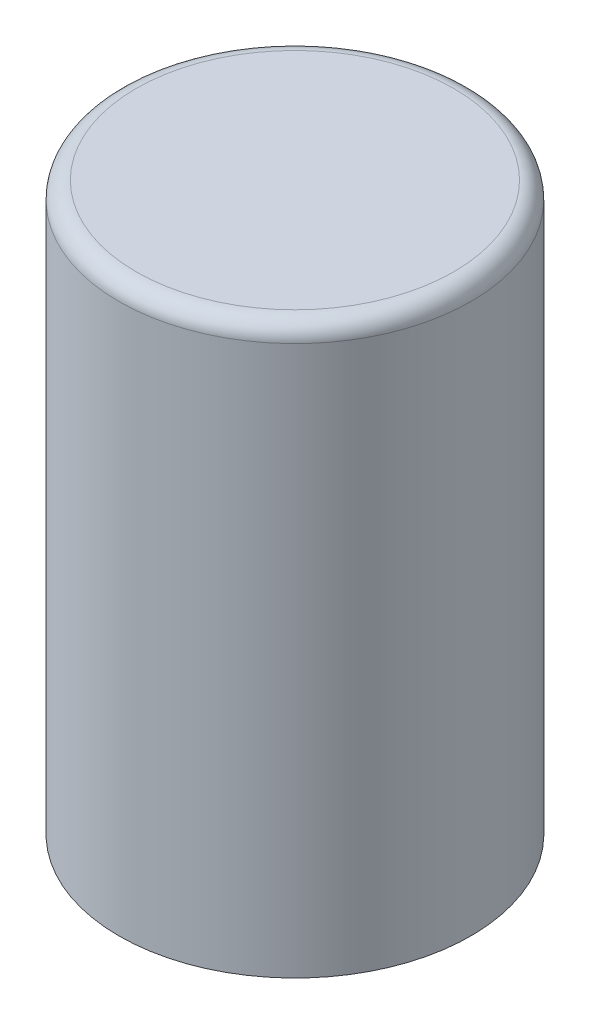
ISO-10303-21;
HEADER;
FILE_DESCRIPTION(('STEP AP214'),'2;1');
FILE_NAME('part.step','',(''),(''),'','','');
FILE_SCHEMA(('AUTOMOTIVE_DESIGN { 1 0 10303 214 1 1 1 1 }'));
ENDSEC;
DATA;
#1=APPLICATION_CONTEXT('core data for automotive mechanical design processes');
#2=APPLICATION_PROTOCOL_DEFINITION('international standard','automotive_design',2000,#1);
#3=PRODUCT_CONTEXT('',#1,'mechanical');
#4=PRODUCT('Part','Part','',(#3));
#5=PRODUCT_RELATED_PRODUCT_CATEGORY('part','',(#4));
#6=PRODUCT_DEFINITION_FORMATION('','',#4);
#7=PRODUCT_DEFINITION_CONTEXT('part definition',#1,'design');
#8=PRODUCT_DEFINITION('design','',#6,#7);
#9=PRODUCT_DEFINITION_SHAPE('','',#8);
#10=(LENGTH_UNIT() NAMED_UNIT(*) SI_UNIT(.MILLI.,.METRE.));
#11=(NAMED_UNIT(*) PLANE_ANGLE_UNIT() SI_UNIT($,.RADIAN.));
#12=(NAMED_UNIT(*) SI_UNIT($,.STERADIAN.) SOLID_ANGLE_UNIT());
#13=UNCERTAINTY_MEASURE_WITH_UNIT(LENGTH_MEASURE(1.E-05),#10,'distance_accuracy_value','');
#14=(GEOMETRIC_REPRESENTATION_CONTEXT(3) GLOBAL_UNCERTAINTY_ASSIGNED_CONTEXT((#13)) GLOBAL_UNIT_ASSIGNED_CONTEXT((#10,
#11,#12)) REPRESENTATION_CONTEXT('',''));
#15=CARTESIAN_POINT('',(0.,0.,0.));
#16=DIRECTION('',(0.,0.,1.));
#17=DIRECTION('',(1.,0.,0.));
#18=AXIS2_PLACEMENT_3D('',#15,#16,#17);
#19=CARTESIAN_POINT('',(26.069305705841,20.447980609798,0.182702431144));
#20=DIRECTION('',(0.,1.,0.));
#21=DIRECTION('',(0.,0.,1.));
#22=AXIS2_PLACEMENT_3D('',#19,#20,#21);
#23=PLANE('',#22);
#24=CARTESIAN_POINT('',(26.069305705841,20.447980609798,0.182702431144));
#25=DIRECTION('',(0.,-1.,0.));
#26=DIRECTION('',(0.,0.,-1.));
#27=AXIS2_PLACEMENT_3D('',#24,#25,#26);
#28=CIRCLE('',#27,4.625);
#29=CARTESIAN_POINT('',(26.069305705841,20.447980609798,-4.442297568856));
#30=VERTEX_POINT('',#29);
#31=CARTESIAN_POINT('',(26.069305705841,20.447980609798,4.807702431144));
#32=VERTEX_POINT('',#31);
#33=EDGE_CURVE('E40',#30,#32,#28,.T.);
#34=ORIENTED_EDGE('',*,*,#33,.F.);
#35=CARTESIAN_POINT('',(26.069305705841,20.447980609798,0.182702431144));
#36=DIRECTION('',(0.,-1.,0.));
#37=DIRECTION('',(0.,0.,1.));
#38=AXIS2_PLACEMENT_3D('',#35,#36,#37);
#39=CIRCLE('',#38,4.625);
#40=EDGE_CURVE('E34',#32,#30,#39,.T.);
#41=ORIENTED_EDGE('',*,*,#40,.F.);
#42=EDGE_LOOP('',(#34,#41));
#43=FACE_BOUND('',#42,.T.);
#44=ADVANCED_FACE('F17',(#43),#23,.T.);
#45=CARTESIAN_POINT('',(26.069305705841,19.947980609798,0.182702431144));
#46=DIRECTION('',(0.,1.,0.));
#47=DIRECTION('',(0.,0.,1.));
#48=AXIS2_PLACEMENT_3D('',#45,#46,#47);
#49=TOROIDAL_SURFACE('',#48,4.625,0.5);
#50=ORIENTED_EDGE('',*,*,#40,.T.);
#51=ORIENTED_EDGE('',*,*,#33,.T.);
#52=EDGE_LOOP('',(#50,#51));
#53=FACE_BOUND('',#52,.T.);
#54=CARTESIAN_POINT('',(26.069305705841,19.947980609798,0.182702431144));
#55=DIRECTION('',(0.,1.,0.));
#56=DIRECTION('',(0.,0.,1.));
#57=AXIS2_PLACEMENT_3D('',#54,#55,#56);
#58=CIRCLE('',#57,5.125);
#59=CARTESIAN_POINT('',(26.069305705841,19.947980609798,5.307702431144));
#60=VERTEX_POINT('',#59);
#61=EDGE_CURVE('E27',#60,#60,#58,.F.);
#62=ORIENTED_EDGE('',*,*,#61,.F.);
#63=EDGE_LOOP('',(#62));
#64=FACE_BOUND('',#63,.T.);
#65=ADVANCED_FACE('F38',(#53,#64),#49,.T.);
#66=CARTESIAN_POINT('',(26.069305705841,3.947980609798,0.182702431144));
#67=DIRECTION('',(0.,1.,0.));
#68=DIRECTION('',(0.,0.,1.));
#69=AXIS2_PLACEMENT_3D('',#66,#67,#68);
#70=PLANE('',#69);
#71=CARTESIAN_POINT('',(26.069305705841,3.947980609798,0.182702431144));
#72=DIRECTION('',(0.,1.,0.));
#73=DIRECTION('',(0.,0.,1.));
#74=AXIS2_PLACEMENT_3D('',#71,#72,#73);
#75=CIRCLE('',#74,5.125);
#76=CARTESIAN_POINT('',(26.069305705841,3.947980609798,5.307702431144));
#77=VERTEX_POINT('',#76);
#78=EDGE_CURVE('E11',#77,#77,#75,.T.);
#79=ORIENTED_EDGE('',*,*,#78,.F.);
#80=EDGE_LOOP('',(#79));
#81=FACE_BOUND('',#80,.T.);
#82=ADVANCED_FACE('F73',(#81),#70,.F.);
#83=CARTESIAN_POINT('',(26.069305705841,20.447980609798,0.182702431144));
#84=DIRECTION('',(0.,1.,0.));
#85=DIRECTION('',(0.,0.,1.));
#86=AXIS2_PLACEMENT_3D('',#83,#84,#85);
#87=CYLINDRICAL_SURFACE('',#86,5.125);
#88=ORIENTED_EDGE('',*,*,#78,.T.);
#89=EDGE_LOOP('',(#88));
#90=FACE_BOUND('',#89,.T.);
#91=ORIENTED_EDGE('',*,*,#61,.T.);
#92=EDGE_LOOP('',(#91));
#93=FACE_BOUND('',#92,.T.);
#94=ADVANCED_FACE('F77',(#90,#93),#87,.T.);
#95=CLOSED_SHELL('',(#44,#65,#82,#94));
#96=MANIFOLD_SOLID_BREP('B1',#95);
#97=ADVANCED_BREP_SHAPE_REPRESENTATION('',(#18,#96),#14);
#98=SHAPE_DEFINITION_REPRESENTATION(#9,#97);
ENDSEC;
END-ISO-10303-21;
